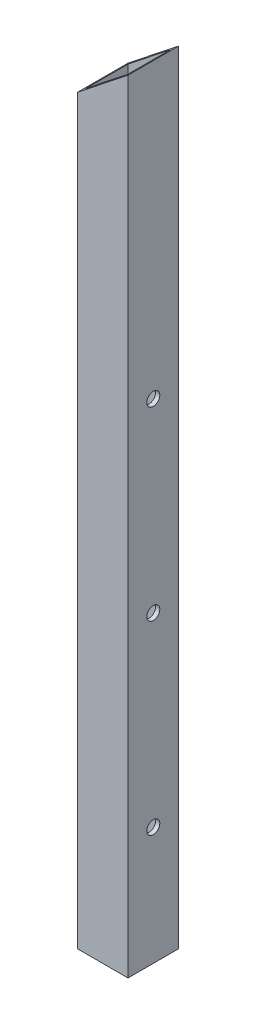
ISO-10303-21;
HEADER;
FILE_DESCRIPTION(('STEP AP214'),'2;1');
FILE_NAME('part.step','',(''),(''),'','','');
FILE_SCHEMA(('AUTOMOTIVE_DESIGN { 1 0 10303 214 1 1 1 1 }'));
ENDSEC;
DATA;
#1=APPLICATION_CONTEXT('core data for automotive mechanical design processes');
#2=APPLICATION_PROTOCOL_DEFINITION('international standard','automotive_design',2000,#1);
#3=PRODUCT_CONTEXT('',#1,'mechanical');
#4=PRODUCT('Part','Part','',(#3));
#5=PRODUCT_RELATED_PRODUCT_CATEGORY('part','',(#4));
#6=PRODUCT_DEFINITION_FORMATION('','',#4);
#7=PRODUCT_DEFINITION_CONTEXT('part definition',#1,'design');
#8=PRODUCT_DEFINITION('design','',#6,#7);
#9=PRODUCT_DEFINITION_SHAPE('','',#8);
#10=(LENGTH_UNIT() NAMED_UNIT(*) SI_UNIT(.MILLI.,.METRE.));
#11=(NAMED_UNIT(*) PLANE_ANGLE_UNIT() SI_UNIT($,.RADIAN.));
#12=(NAMED_UNIT(*) SI_UNIT($,.STERADIAN.) SOLID_ANGLE_UNIT());
#13=UNCERTAINTY_MEASURE_WITH_UNIT(LENGTH_MEASURE(1.E-05),#10,'distance_accuracy_value','');
#14=(GEOMETRIC_REPRESENTATION_CONTEXT(3) GLOBAL_UNCERTAINTY_ASSIGNED_CONTEXT((#13)) GLOBAL_UNIT_ASSIGNED_CONTEXT((#10,
#11,#12)) REPRESENTATION_CONTEXT('',''));
#15=CARTESIAN_POINT('',(0.,0.,0.));
#16=DIRECTION('',(0.,0.,1.));
#17=DIRECTION('',(1.,0.,0.));
#18=AXIS2_PLACEMENT_3D('',#15,#16,#17);
#19=CARTESIAN_POINT('',(-685.8,596.9,-38.1));
#20=DIRECTION('',(-1.,0.,0.));
#21=DIRECTION('',(0.,0.,1.));
#22=AXIS2_PLACEMENT_3D('',#19,#20,#21);
#23=PLANE('',#22);
#24=CARTESIAN_POINT('',(-685.8,127.,-19.0499999999999));
#25=DIRECTION('',(-1.,0.,0.));
#26=DIRECTION('',(0.,0.,1.));
#27=AXIS2_PLACEMENT_3D('',#24,#25,#26);
#28=CIRCLE('',#27,4.9022);
#29=CARTESIAN_POINT('',(-685.8,127.,-14.1477999999999));
#30=VERTEX_POINT('',#29);
#31=EDGE_CURVE('E199',#30,#30,#28,.F.);
#32=ORIENTED_EDGE('',*,*,#31,.F.);
#33=EDGE_LOOP('',(#32));
#34=FACE_BOUND('',#33,.T.);
#35=CARTESIAN_POINT('',(-685.8,406.4,-19.0500000000001));
#36=DIRECTION('',(-1.,0.,0.));
#37=DIRECTION('',(0.,0.,1.));
#38=AXIS2_PLACEMENT_3D('',#35,#36,#37);
#39=CIRCLE('',#38,4.90219999999997);
#40=CARTESIAN_POINT('',(-685.8,406.4,-14.1478000000001));
#41=VERTEX_POINT('',#40);
#42=EDGE_CURVE('E190',#41,#41,#39,.F.);
#43=ORIENTED_EDGE('',*,*,#42,.F.);
#44=EDGE_LOOP('',(#43));
#45=FACE_BOUND('',#44,.T.);
#46=DIRECTION('',(0.,0.,1.));
#47=VECTOR('',#46,1.);
#48=CARTESIAN_POINT('',(-685.8,38.0999999999999,-38.1));
#49=LINE('',#48,#47);
#50=CARTESIAN_POINT('',(-685.8,38.0999999999999,-38.1));
#51=VERTEX_POINT('',#50);
#52=CARTESIAN_POINT('',(-685.8,38.0999999999999,0.));
#53=VERTEX_POINT('',#52);
#54=EDGE_CURVE('E104',#51,#53,#49,.T.);
#55=ORIENTED_EDGE('',*,*,#54,.F.);
#56=DIRECTION('',(0.,-1.,0.));
#57=VECTOR('',#56,1.);
#58=CARTESIAN_POINT('',(-685.8,596.9,-38.1));
#59=LINE('',#58,#57);
#60=CARTESIAN_POINT('',(-685.8,627.101219512195,-38.1));
#61=VERTEX_POINT('',#60);
#62=EDGE_CURVE('E113',#61,#51,#59,.T.);
#63=ORIENTED_EDGE('',*,*,#62,.F.);
#64=DIRECTION('',(0.,0.,-1.));
#65=VECTOR('',#64,1.);
#66=CARTESIAN_POINT('',(-685.8,627.101219512195,-38.1));
#67=LINE('',#66,#65);
#68=CARTESIAN_POINT('',(-685.8,627.101219512195,0.));
#69=VERTEX_POINT('',#68);
#70=EDGE_CURVE('E154',#69,#61,#67,.T.);
#71=ORIENTED_EDGE('',*,*,#70,.F.);
#72=DIRECTION('',(0.,-1.,0.));
#73=VECTOR('',#72,1.);
#74=CARTESIAN_POINT('',(-685.8,596.9,0.));
#75=LINE('',#74,#73);
#76=EDGE_CURVE('E120',#69,#53,#75,.T.);
#77=ORIENTED_EDGE('',*,*,#76,.T.);
#78=EDGE_LOOP('',(#55,#63,#71,#77));
#79=FACE_BOUND('',#78,.T.);
#80=CARTESIAN_POINT('',(-685.8,266.7,-19.05));
#81=DIRECTION('',(-1.,0.,0.));
#82=DIRECTION('',(0.,0.,1.));
#83=AXIS2_PLACEMENT_3D('',#80,#81,#82);
#84=CIRCLE('',#83,4.9022);
#85=CARTESIAN_POINT('',(-685.8,266.7,-14.1478));
#86=VERTEX_POINT('',#85);
#87=EDGE_CURVE('E178',#86,#86,#84,.F.);
#88=ORIENTED_EDGE('',*,*,#87,.F.);
#89=EDGE_LOOP('',(#88));
#90=FACE_BOUND('',#89,.T.);
#91=ADVANCED_FACE('F33',(#34,#45,#79,#90),#23,.F.);
#92=CARTESIAN_POINT('',(-723.9,596.9,-38.1));
#93=DIRECTION('',(1.,0.,0.));
#94=DIRECTION('',(0.,0.,-1.));
#95=AXIS2_PLACEMENT_3D('',#92,#93,#94);
#96=PLANE('',#95);
#97=CARTESIAN_POINT('',(-723.9,127.,-19.0499999999999));
#98=DIRECTION('',(-1.,0.,0.));
#99=DIRECTION('',(0.,0.,1.));
#100=AXIS2_PLACEMENT_3D('',#97,#98,#99);
#101=CIRCLE('',#100,4.9022);
#102=CARTESIAN_POINT('',(-723.9,127.,-14.1477999999999));
#103=VERTEX_POINT('',#102);
#104=EDGE_CURVE('E200',#103,#103,#101,.T.);
#105=ORIENTED_EDGE('',*,*,#104,.F.);
#106=EDGE_LOOP('',(#105));
#107=FACE_BOUND('',#106,.T.);
#108=CARTESIAN_POINT('',(-723.9,406.4,-19.0500000000001));
#109=DIRECTION('',(-1.,0.,0.));
#110=DIRECTION('',(0.,0.,1.));
#111=AXIS2_PLACEMENT_3D('',#108,#109,#110);
#112=CIRCLE('',#111,4.90219999999997);
#113=CARTESIAN_POINT('',(-723.9,406.4,-14.1478000000001));
#114=VERTEX_POINT('',#113);
#115=EDGE_CURVE('E187',#114,#114,#112,.T.);
#116=ORIENTED_EDGE('',*,*,#115,.F.);
#117=EDGE_LOOP('',(#116));
#118=FACE_BOUND('',#117,.T.);
#119=CARTESIAN_POINT('',(-723.9,266.7,-19.05));
#120=DIRECTION('',(-1.,0.,0.));
#121=DIRECTION('',(0.,0.,1.));
#122=AXIS2_PLACEMENT_3D('',#119,#120,#121);
#123=CIRCLE('',#122,4.90220000000002);
#124=CARTESIAN_POINT('',(-723.9,266.7,-14.1477999999999));
#125=VERTEX_POINT('',#124);
#126=EDGE_CURVE('E179',#125,#125,#123,.T.);
#127=ORIENTED_EDGE('',*,*,#126,.F.);
#128=EDGE_LOOP('',(#127));
#129=FACE_BOUND('',#128,.T.);
#130=DIRECTION('',(0.,0.,-1.));
#131=VECTOR('',#130,1.);
#132=CARTESIAN_POINT('',(-723.9,38.0999999999999,-38.1));
#133=LINE('',#132,#131);
#134=CARTESIAN_POINT('',(-723.9,38.0999999999999,0.));
#135=VERTEX_POINT('',#134);
#136=CARTESIAN_POINT('',(-723.9,38.0999999999999,-38.1));
#137=VERTEX_POINT('',#136);
#138=EDGE_CURVE('E95',#135,#137,#133,.T.);
#139=ORIENTED_EDGE('',*,*,#138,.F.);
#140=DIRECTION('',(0.,-1.,0.));
#141=VECTOR('',#140,1.);
#142=CARTESIAN_POINT('',(-723.9,596.9,0.));
#143=LINE('',#142,#141);
#144=CARTESIAN_POINT('',(-723.9,596.9,0.));
#145=VERTEX_POINT('',#144);
#146=EDGE_CURVE('E130',#145,#135,#143,.T.);
#147=ORIENTED_EDGE('',*,*,#146,.F.);
#148=DIRECTION('',(0.,0.,1.));
#149=VECTOR('',#148,1.);
#150=CARTESIAN_POINT('',(-723.9,596.9,-38.1));
#151=LINE('',#150,#149);
#152=CARTESIAN_POINT('',(-723.9,596.9,-38.1));
#153=VERTEX_POINT('',#152);
#154=EDGE_CURVE('E117',#153,#145,#151,.T.);
#155=ORIENTED_EDGE('',*,*,#154,.F.);
#156=DIRECTION('',(0.,-1.,0.));
#157=VECTOR('',#156,1.);
#158=CARTESIAN_POINT('',(-723.9,596.9,-38.1));
#159=LINE('',#158,#157);
#160=EDGE_CURVE('E111',#153,#137,#159,.T.);
#161=ORIENTED_EDGE('',*,*,#160,.T.);
#162=EDGE_LOOP('',(#139,#147,#155,#161));
#163=FACE_BOUND('',#162,.T.);
#164=ADVANCED_FACE('F35',(#107,#118,#129,#163),#96,.F.);
#165=CARTESIAN_POINT('',(-685.8,596.9,0.));
#166=DIRECTION('',(0.,0.,-1.));
#167=DIRECTION('',(-1.,0.,0.));
#168=AXIS2_PLACEMENT_3D('',#165,#166,#167);
#169=PLANE('',#168);
#170=DIRECTION('',(1.,0.,0.));
#171=VECTOR('',#170,1.);
#172=CARTESIAN_POINT('',(-723.9,38.0999999999999,0.));
#173=LINE('',#172,#171);
#174=EDGE_CURVE('E49',#135,#53,#173,.T.);
#175=ORIENTED_EDGE('',*,*,#174,.T.);
#176=ORIENTED_EDGE('',*,*,#76,.F.);
#177=DIRECTION('',(0.783658095702396,0.621192392934826,0.));
#178=VECTOR('',#177,1.);
#179=CARTESIAN_POINT('',(-700.502027582428,615.447173257832,0.));
#180=LINE('',#179,#178);
#181=EDGE_CURVE('E122',#145,#69,#180,.T.);
#182=ORIENTED_EDGE('',*,*,#181,.F.);
#183=ORIENTED_EDGE('',*,*,#146,.T.);
#184=EDGE_LOOP('',(#175,#176,#182,#183));
#185=FACE_BOUND('',#184,.T.);
#186=ADVANCED_FACE('F253',(#185),#169,.F.);
#187=CARTESIAN_POINT('',(-685.8,596.9,-38.1));
#188=DIRECTION('',(0.,0.,1.));
#189=DIRECTION('',(1.,0.,0.));
#190=AXIS2_PLACEMENT_3D('',#187,#188,#189);
#191=PLANE('',#190);
#192=DIRECTION('',(1.,0.,0.));
#193=VECTOR('',#192,1.);
#194=CARTESIAN_POINT('',(-723.9,38.0999999999999,-38.1));
#195=LINE('',#194,#193);
#196=EDGE_CURVE('E98',#137,#51,#195,.T.);
#197=ORIENTED_EDGE('',*,*,#196,.F.);
#198=ORIENTED_EDGE('',*,*,#160,.F.);
#199=DIRECTION('',(-0.783658095702396,-0.621192392934826,0.));
#200=VECTOR('',#199,1.);
#201=CARTESIAN_POINT('',(-700.502027582428,615.447173257832,-38.1));
#202=LINE('',#201,#200);
#203=EDGE_CURVE('E157',#61,#153,#202,.T.);
#204=ORIENTED_EDGE('',*,*,#203,.F.);
#205=ORIENTED_EDGE('',*,*,#62,.T.);
#206=EDGE_LOOP('',(#197,#198,#204,#205));
#207=FACE_BOUND('',#206,.T.);
#208=ADVANCED_FACE('F109',(#207),#191,.F.);
#209=CARTESIAN_POINT('',(-723.9,596.9,-38.1));
#210=DIRECTION('',(-0.621192392934826,0.783658095702396,0.));
#211=DIRECTION('',(-0.783658095702396,-0.621192392934826,0.));
#212=AXIS2_PLACEMENT_3D('',#209,#210,#211);
#213=PLANE('',#212);
#214=DIRECTION('',(0.,0.,1.));
#215=VECTOR('',#214,1.);
#216=CARTESIAN_POINT('',(-720.725,599.416768292683,-34.925));
#217=LINE('',#216,#215);
#218=CARTESIAN_POINT('',(-720.725,599.416768292683,-34.925));
#219=VERTEX_POINT('',#218);
#220=CARTESIAN_POINT('',(-720.725,599.416768292683,-3.175));
#221=VERTEX_POINT('',#220);
#222=EDGE_CURVE('E159',#219,#221,#217,.T.);
#223=ORIENTED_EDGE('',*,*,#222,.F.);
#224=DIRECTION('',(-0.783658095702396,-0.621192392934826,0.));
#225=VECTOR('',#224,1.);
#226=CARTESIAN_POINT('',(-702.451858617225,613.901575486345,-34.925));
#227=LINE('',#226,#225);
#228=CARTESIAN_POINT('',(-688.975,624.584451219512,-34.925));
#229=VERTEX_POINT('',#228);
#230=EDGE_CURVE('E162',#229,#219,#227,.T.);
#231=ORIENTED_EDGE('',*,*,#230,.F.);
#232=DIRECTION('',(0.,0.,-1.));
#233=VECTOR('',#232,1.);
#234=CARTESIAN_POINT('',(-688.975,624.584451219512,-34.925));
#235=LINE('',#234,#233);
#236=CARTESIAN_POINT('',(-688.975,624.584451219512,-3.175));
#237=VERTEX_POINT('',#236);
#238=EDGE_CURVE('E164',#237,#229,#235,.T.);
#239=ORIENTED_EDGE('',*,*,#238,.F.);
#240=DIRECTION('',(0.783658095702396,0.621192392934826,0.));
#241=VECTOR('',#240,1.);
#242=CARTESIAN_POINT('',(-702.451858617225,613.901575486345,-3.175));
#243=LINE('',#242,#241);
#244=EDGE_CURVE('E42',#221,#237,#243,.T.);
#245=ORIENTED_EDGE('',*,*,#244,.F.);
#246=EDGE_LOOP('',(#223,#231,#239,#245));
#247=FACE_BOUND('',#246,.T.);
#248=ORIENTED_EDGE('',*,*,#203,.T.);
#249=ORIENTED_EDGE('',*,*,#154,.T.);
#250=ORIENTED_EDGE('',*,*,#181,.T.);
#251=ORIENTED_EDGE('',*,*,#70,.T.);
#252=EDGE_LOOP('',(#248,#249,#250,#251));
#253=FACE_BOUND('',#252,.T.);
#254=ADVANCED_FACE('F235',(#247,#253),#213,.T.);
#255=CARTESIAN_POINT('',(-720.725,596.9,-34.925));
#256=DIRECTION('',(1.,0.,0.));
#257=DIRECTION('',(0.,0.,-1.));
#258=AXIS2_PLACEMENT_3D('',#255,#256,#257);
#259=PLANE('',#258);
#260=CARTESIAN_POINT('',(-720.725,127.,-19.0499999999999));
#261=DIRECTION('',(1.,0.,0.));
#262=DIRECTION('',(0.,0.,-1.));
#263=AXIS2_PLACEMENT_3D('',#260,#261,#262);
#264=CIRCLE('',#263,4.9022);
#265=CARTESIAN_POINT('',(-720.725,127.,-23.9521999999999));
#266=VERTEX_POINT('',#265);
#267=EDGE_CURVE('E191',#266,#266,#264,.T.);
#268=ORIENTED_EDGE('',*,*,#267,.F.);
#269=EDGE_LOOP('',(#268));
#270=FACE_BOUND('',#269,.T.);
#271=CARTESIAN_POINT('',(-720.725,406.4,-19.0500000000001));
#272=DIRECTION('',(1.,0.,0.));
#273=DIRECTION('',(0.,0.,-1.));
#274=AXIS2_PLACEMENT_3D('',#271,#272,#273);
#275=CIRCLE('',#274,4.90219999999997);
#276=CARTESIAN_POINT('',(-720.725,406.4,-23.9522));
#277=VERTEX_POINT('',#276);
#278=EDGE_CURVE('E182',#277,#277,#275,.T.);
#279=ORIENTED_EDGE('',*,*,#278,.F.);
#280=EDGE_LOOP('',(#279));
#281=FACE_BOUND('',#280,.T.);
#282=CARTESIAN_POINT('',(-720.725,266.7,-19.05));
#283=DIRECTION('',(1.,0.,0.));
#284=DIRECTION('',(0.,0.,-1.));
#285=AXIS2_PLACEMENT_3D('',#282,#283,#284);
#286=CIRCLE('',#285,4.9022);
#287=CARTESIAN_POINT('',(-720.725,266.7,-23.9522));
#288=VERTEX_POINT('',#287);
#289=EDGE_CURVE('E114',#288,#288,#286,.T.);
#290=ORIENTED_EDGE('',*,*,#289,.F.);
#291=EDGE_LOOP('',(#290));
#292=FACE_BOUND('',#291,.T.);
#293=DIRECTION('',(0.,-1.,0.));
#294=VECTOR('',#293,1.);
#295=CARTESIAN_POINT('',(-720.725,596.9,-3.175));
#296=LINE('',#295,#294);
#297=CARTESIAN_POINT('',(-720.725,38.0999999999999,-3.175));
#298=VERTEX_POINT('',#297);
#299=EDGE_CURVE('E132',#221,#298,#296,.T.);
#300=ORIENTED_EDGE('',*,*,#299,.T.);
#301=DIRECTION('',(0.,0.,-1.));
#302=VECTOR('',#301,1.);
#303=CARTESIAN_POINT('',(-720.725,38.0999999999999,-34.925));
#304=LINE('',#303,#302);
#305=CARTESIAN_POINT('',(-720.725,38.0999999999999,-34.925));
#306=VERTEX_POINT('',#305);
#307=EDGE_CURVE('E11',#298,#306,#304,.T.);
#308=ORIENTED_EDGE('',*,*,#307,.T.);
#309=DIRECTION('',(0.,-1.,0.));
#310=VECTOR('',#309,1.);
#311=CARTESIAN_POINT('',(-720.725,596.9,-34.925));
#312=LINE('',#311,#310);
#313=EDGE_CURVE('E125',#219,#306,#312,.T.);
#314=ORIENTED_EDGE('',*,*,#313,.F.);
#315=ORIENTED_EDGE('',*,*,#222,.T.);
#316=EDGE_LOOP('',(#300,#308,#314,#315));
#317=FACE_BOUND('',#316,.T.);
#318=ADVANCED_FACE('F238',(#270,#281,#292,#317),#259,.T.);
#319=CARTESIAN_POINT('',(-688.975,596.9,-34.925));
#320=DIRECTION('',(0.,0.,1.));
#321=DIRECTION('',(1.,0.,0.));
#322=AXIS2_PLACEMENT_3D('',#319,#320,#321);
#323=PLANE('',#322);
#324=ORIENTED_EDGE('',*,*,#313,.T.);
#325=DIRECTION('',(1.,0.,0.));
#326=VECTOR('',#325,1.);
#327=CARTESIAN_POINT('',(-688.975,38.0999999999999,-34.925));
#328=LINE('',#327,#326);
#329=CARTESIAN_POINT('',(-688.975,38.0999999999999,-34.925));
#330=VERTEX_POINT('',#329);
#331=EDGE_CURVE('E57',#306,#330,#328,.T.);
#332=ORIENTED_EDGE('',*,*,#331,.T.);
#333=DIRECTION('',(0.,-1.,0.));
#334=VECTOR('',#333,1.);
#335=CARTESIAN_POINT('',(-688.975,596.9,-34.925));
#336=LINE('',#335,#334);
#337=EDGE_CURVE('E138',#229,#330,#336,.T.);
#338=ORIENTED_EDGE('',*,*,#337,.F.);
#339=ORIENTED_EDGE('',*,*,#230,.T.);
#340=EDGE_LOOP('',(#324,#332,#338,#339));
#341=FACE_BOUND('',#340,.T.);
#342=ADVANCED_FACE('F245',(#341),#323,.T.);
#343=CARTESIAN_POINT('',(-688.975,596.9,-34.925));
#344=DIRECTION('',(-1.,0.,0.));
#345=DIRECTION('',(0.,0.,1.));
#346=AXIS2_PLACEMENT_3D('',#343,#344,#345);
#347=PLANE('',#346);
#348=CARTESIAN_POINT('',(-688.975,127.,-19.0499999999999));
#349=DIRECTION('',(-1.,0.,0.));
#350=DIRECTION('',(0.,0.,1.));
#351=AXIS2_PLACEMENT_3D('',#348,#349,#350);
#352=CIRCLE('',#351,4.9022);
#353=CARTESIAN_POINT('',(-688.975,127.,-14.1477999999999));
#354=VERTEX_POINT('',#353);
#355=EDGE_CURVE('E196',#354,#354,#352,.T.);
#356=ORIENTED_EDGE('',*,*,#355,.F.);
#357=EDGE_LOOP('',(#356));
#358=FACE_BOUND('',#357,.T.);
#359=CARTESIAN_POINT('',(-688.975,406.4,-19.0500000000001));
#360=DIRECTION('',(-1.,0.,0.));
#361=DIRECTION('',(0.,0.,1.));
#362=AXIS2_PLACEMENT_3D('',#359,#360,#361);
#363=CIRCLE('',#362,4.90219999999997);
#364=CARTESIAN_POINT('',(-688.975,406.4,-14.1478000000001));
#365=VERTEX_POINT('',#364);
#366=EDGE_CURVE('E37',#365,#365,#363,.T.);
#367=ORIENTED_EDGE('',*,*,#366,.F.);
#368=EDGE_LOOP('',(#367));
#369=FACE_BOUND('',#368,.T.);
#370=CARTESIAN_POINT('',(-688.975,266.7,-19.05));
#371=DIRECTION('',(-1.,0.,0.));
#372=DIRECTION('',(0.,0.,1.));
#373=AXIS2_PLACEMENT_3D('',#370,#371,#372);
#374=CIRCLE('',#373,4.9022);
#375=CARTESIAN_POINT('',(-688.975,266.7,-14.1478));
#376=VERTEX_POINT('',#375);
#377=EDGE_CURVE('E175',#376,#376,#374,.T.);
#378=ORIENTED_EDGE('',*,*,#377,.F.);
#379=EDGE_LOOP('',(#378));
#380=FACE_BOUND('',#379,.T.);
#381=ORIENTED_EDGE('',*,*,#337,.T.);
#382=DIRECTION('',(0.,0.,1.));
#383=VECTOR('',#382,1.);
#384=CARTESIAN_POINT('',(-688.975,38.0999999999999,-34.925));
#385=LINE('',#384,#383);
#386=CARTESIAN_POINT('',(-688.975,38.0999999999999,-3.175));
#387=VERTEX_POINT('',#386);
#388=EDGE_CURVE('E169',#330,#387,#385,.T.);
#389=ORIENTED_EDGE('',*,*,#388,.T.);
#390=DIRECTION('',(0.,-1.,0.));
#391=VECTOR('',#390,1.);
#392=CARTESIAN_POINT('',(-688.975,596.9,-3.175));
#393=LINE('',#392,#391);
#394=EDGE_CURVE('E143',#237,#387,#393,.T.);
#395=ORIENTED_EDGE('',*,*,#394,.F.);
#396=ORIENTED_EDGE('',*,*,#238,.T.);
#397=EDGE_LOOP('',(#381,#389,#395,#396));
#398=FACE_BOUND('',#397,.T.);
#399=ADVANCED_FACE('F242',(#358,#369,#380,#398),#347,.T.);
#400=CARTESIAN_POINT('',(-688.975,596.9,-3.175));
#401=DIRECTION('',(0.,0.,-1.));
#402=DIRECTION('',(-1.,0.,0.));
#403=AXIS2_PLACEMENT_3D('',#400,#401,#402);
#404=PLANE('',#403);
#405=ORIENTED_EDGE('',*,*,#394,.T.);
#406=DIRECTION('',(-1.,0.,0.));
#407=VECTOR('',#406,1.);
#408=CARTESIAN_POINT('',(-688.975,38.0999999999999,-3.175));
#409=LINE('',#408,#407);
#410=EDGE_CURVE('E105',#387,#298,#409,.T.);
#411=ORIENTED_EDGE('',*,*,#410,.T.);
#412=ORIENTED_EDGE('',*,*,#299,.F.);
#413=ORIENTED_EDGE('',*,*,#244,.T.);
#414=EDGE_LOOP('',(#405,#411,#412,#413));
#415=FACE_BOUND('',#414,.T.);
#416=ADVANCED_FACE('F234',(#415),#404,.T.);
#417=CARTESIAN_POINT('',(-723.9,38.0999999999999,-38.1));
#418=DIRECTION('',(0.,-1.,0.));
#419=DIRECTION('',(1.,0.,0.));
#420=AXIS2_PLACEMENT_3D('',#417,#418,#419);
#421=PLANE('',#420);
#422=ORIENTED_EDGE('',*,*,#388,.F.);
#423=ORIENTED_EDGE('',*,*,#331,.F.);
#424=ORIENTED_EDGE('',*,*,#307,.F.);
#425=ORIENTED_EDGE('',*,*,#410,.F.);
#426=EDGE_LOOP('',(#422,#423,#424,#425));
#427=FACE_BOUND('',#426,.T.);
#428=ORIENTED_EDGE('',*,*,#54,.T.);
#429=ORIENTED_EDGE('',*,*,#174,.F.);
#430=ORIENTED_EDGE('',*,*,#138,.T.);
#431=ORIENTED_EDGE('',*,*,#196,.T.);
#432=EDGE_LOOP('',(#428,#429,#430,#431));
#433=FACE_BOUND('',#432,.T.);
#434=ADVANCED_FACE('F97',(#427,#433),#421,.T.);
#435=CARTESIAN_POINT('',(-723.9,266.7,-19.05));
#436=DIRECTION('',(-1.,0.,0.));
#437=DIRECTION('',(0.,0.,1.));
#438=AXIS2_PLACEMENT_3D('',#435,#436,#437);
#439=CYLINDRICAL_SURFACE('',#438,4.9022);
#440=ORIENTED_EDGE('',*,*,#289,.T.);
#441=EDGE_LOOP('',(#440));
#442=FACE_BOUND('',#441,.T.);
#443=ORIENTED_EDGE('',*,*,#126,.T.);
#444=EDGE_LOOP('',(#443));
#445=FACE_BOUND('',#444,.T.);
#446=ADVANCED_FACE('F219',(#442,#445),#439,.F.);
#447=ORIENTED_EDGE('',*,*,#377,.T.);
#448=EDGE_LOOP('',(#447));
#449=FACE_BOUND('',#448,.T.);
#450=ORIENTED_EDGE('',*,*,#87,.T.);
#451=EDGE_LOOP('',(#450));
#452=FACE_BOUND('',#451,.T.);
#453=ADVANCED_FACE('F216',(#449,#452),#439,.F.);
#454=CARTESIAN_POINT('',(-723.9,406.4,-19.0500000000001));
#455=DIRECTION('',(-1.,0.,0.));
#456=DIRECTION('',(0.,0.,1.));
#457=AXIS2_PLACEMENT_3D('',#454,#455,#456);
#458=CYLINDRICAL_SURFACE('',#457,4.90219999999997);
#459=ORIENTED_EDGE('',*,*,#366,.T.);
#460=EDGE_LOOP('',(#459));
#461=FACE_BOUND('',#460,.T.);
#462=ORIENTED_EDGE('',*,*,#42,.T.);
#463=EDGE_LOOP('',(#462));
#464=FACE_BOUND('',#463,.T.);
#465=ADVANCED_FACE('F218',(#461,#464),#458,.F.);
#466=ORIENTED_EDGE('',*,*,#278,.T.);
#467=EDGE_LOOP('',(#466));
#468=FACE_BOUND('',#467,.T.);
#469=ORIENTED_EDGE('',*,*,#115,.T.);
#470=EDGE_LOOP('',(#469));
#471=FACE_BOUND('',#470,.T.);
#472=ADVANCED_FACE('F226',(#468,#471),#458,.F.);
#473=CARTESIAN_POINT('',(-723.9,127.,-19.0499999999999));
#474=DIRECTION('',(-1.,0.,0.));
#475=DIRECTION('',(0.,0.,1.));
#476=AXIS2_PLACEMENT_3D('',#473,#474,#475);
#477=CYLINDRICAL_SURFACE('',#476,4.9022);
#478=ORIENTED_EDGE('',*,*,#267,.T.);
#479=EDGE_LOOP('',(#478));
#480=FACE_BOUND('',#479,.T.);
#481=ORIENTED_EDGE('',*,*,#104,.T.);
#482=EDGE_LOOP('',(#481));
#483=FACE_BOUND('',#482,.T.);
#484=ADVANCED_FACE('F272',(#480,#483),#477,.F.);
#485=ORIENTED_EDGE('',*,*,#355,.T.);
#486=EDGE_LOOP('',(#485));
#487=FACE_BOUND('',#486,.T.);
#488=ORIENTED_EDGE('',*,*,#31,.T.);
#489=EDGE_LOOP('',(#488));
#490=FACE_BOUND('',#489,.T.);
#491=ADVANCED_FACE('F206',(#487,#490),#477,.F.);
#492=CLOSED_SHELL('',(#91,#164,#186,#208,#254,#318,#342,#399,#416,#434,#446,#453,#465,#472,#484,#491));
#493=MANIFOLD_SOLID_BREP('B2',#492);
#494=ADVANCED_BREP_SHAPE_REPRESENTATION('',(#18,#493),#14);
#495=SHAPE_DEFINITION_REPRESENTATION(#9,#494);
ENDSEC;
END-ISO-10303-21;
